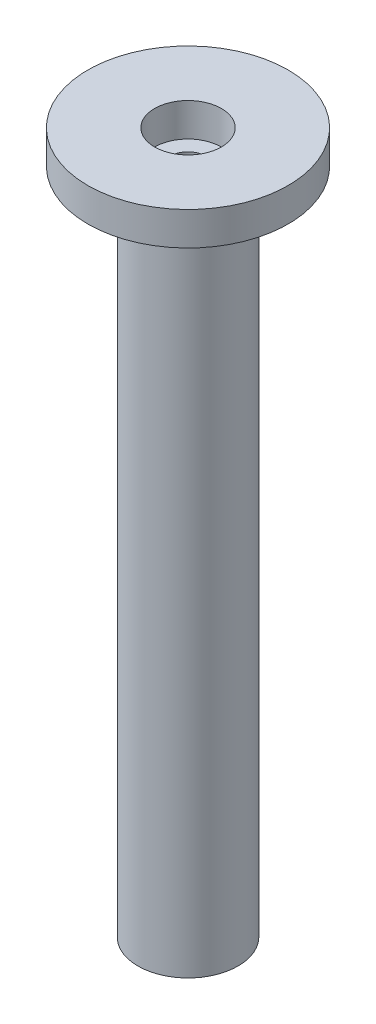
ISO-10303-21;
HEADER;
FILE_DESCRIPTION(('STEP AP214'),'2;1');
FILE_NAME('part.step','',(''),(''),'','','');
FILE_SCHEMA(('AUTOMOTIVE_DESIGN { 1 0 10303 214 1 1 1 1 }'));
ENDSEC;
DATA;
#1=APPLICATION_CONTEXT('core data for automotive mechanical design processes');
#2=APPLICATION_PROTOCOL_DEFINITION('international standard','automotive_design',2000,#1);
#3=PRODUCT_CONTEXT('',#1,'mechanical');
#4=PRODUCT('Part','Part','',(#3));
#5=PRODUCT_RELATED_PRODUCT_CATEGORY('part','',(#4));
#6=PRODUCT_DEFINITION_FORMATION('','',#4);
#7=PRODUCT_DEFINITION_CONTEXT('part definition',#1,'design');
#8=PRODUCT_DEFINITION('design','',#6,#7);
#9=PRODUCT_DEFINITION_SHAPE('','',#8);
#10=(LENGTH_UNIT() NAMED_UNIT(*) SI_UNIT(.MILLI.,.METRE.));
#11=(NAMED_UNIT(*) PLANE_ANGLE_UNIT() SI_UNIT($,.RADIAN.));
#12=(NAMED_UNIT(*) SI_UNIT($,.STERADIAN.) SOLID_ANGLE_UNIT());
#13=UNCERTAINTY_MEASURE_WITH_UNIT(LENGTH_MEASURE(1.E-05),#10,'distance_accuracy_value','');
#14=(GEOMETRIC_REPRESENTATION_CONTEXT(3) GLOBAL_UNCERTAINTY_ASSIGNED_CONTEXT((#13)) GLOBAL_UNIT_ASSIGNED_CONTEXT((#10,
#11,#12)) REPRESENTATION_CONTEXT('',''));
#15=CARTESIAN_POINT('',(0.,0.,0.));
#16=DIRECTION('',(0.,0.,1.));
#17=DIRECTION('',(1.,0.,0.));
#18=AXIS2_PLACEMENT_3D('',#15,#16,#17);
#19=CARTESIAN_POINT('',(0.,127.,0.));
#20=DIRECTION('',(0.,-1.,0.));
#21=DIRECTION('',(0.,0.,-1.));
#22=AXIS2_PLACEMENT_3D('',#19,#20,#21);
#23=CYLINDRICAL_SURFACE('',#22,9.525);
#24=CARTESIAN_POINT('',(0.,127.,0.));
#25=DIRECTION('',(0.,1.,0.));
#26=DIRECTION('',(0.,0.,1.));
#27=AXIS2_PLACEMENT_3D('',#24,#25,#26);
#28=CIRCLE('',#27,9.525);
#29=CARTESIAN_POINT('',(0.,127.,9.525));
#30=VERTEX_POINT('',#29);
#31=EDGE_CURVE('E12',#30,#30,#28,.T.);
#32=ORIENTED_EDGE('',*,*,#31,.F.);
#33=EDGE_LOOP('',(#32));
#34=FACE_BOUND('',#33,.T.);
#35=CARTESIAN_POINT('',(0.,0.,0.));
#36=DIRECTION('',(0.,1.,0.));
#37=DIRECTION('',(0.,0.,1.));
#38=AXIS2_PLACEMENT_3D('',#35,#36,#37);
#39=CIRCLE('',#38,9.525);
#40=CARTESIAN_POINT('',(0.,0.,9.525));
#41=VERTEX_POINT('',#40);
#42=EDGE_CURVE('E46',#41,#41,#39,.T.);
#43=ORIENTED_EDGE('',*,*,#42,.T.);
#44=EDGE_LOOP('',(#43));
#45=FACE_BOUND('',#44,.T.);
#46=ADVANCED_FACE('F43',(#34,#45),#23,.T.);
#47=CARTESIAN_POINT('',(0.,0.,0.));
#48=DIRECTION('',(0.,1.,0.));
#49=DIRECTION('',(0.,0.,1.));
#50=AXIS2_PLACEMENT_3D('',#47,#48,#49);
#51=PLANE('',#50);
#52=CARTESIAN_POINT('',(0.,0.,0.));
#53=DIRECTION('',(0.,-1.,0.));
#54=DIRECTION('',(0.,0.,-1.));
#55=AXIS2_PLACEMENT_3D('',#52,#53,#54);
#56=CIRCLE('',#55,6.35);
#57=CARTESIAN_POINT('',(0.,0.,-6.35));
#58=VERTEX_POINT('',#57);
#59=EDGE_CURVE('E67',#58,#58,#56,.T.);
#60=ORIENTED_EDGE('',*,*,#59,.F.);
#61=EDGE_LOOP('',(#60));
#62=FACE_BOUND('',#61,.T.);
#63=ORIENTED_EDGE('',*,*,#42,.F.);
#64=EDGE_LOOP('',(#63));
#65=FACE_BOUND('',#64,.T.);
#66=ADVANCED_FACE('F94',(#62,#65),#51,.F.);
#67=CARTESIAN_POINT('',(0.,127.,0.));
#68=DIRECTION('',(0.,1.,0.));
#69=DIRECTION('',(0.,0.,1.));
#70=AXIS2_PLACEMENT_3D('',#67,#68,#69);
#71=PLANE('',#70);
#72=CARTESIAN_POINT('',(0.,127.,0.));
#73=DIRECTION('',(0.,1.,0.));
#74=DIRECTION('',(0.,0.,1.));
#75=AXIS2_PLACEMENT_3D('',#72,#73,#74);
#76=CIRCLE('',#75,19.05);
#77=CARTESIAN_POINT('',(0.,127.,19.05));
#78=VERTEX_POINT('',#77);
#79=EDGE_CURVE('E55',#78,#78,#76,.T.);
#80=ORIENTED_EDGE('',*,*,#79,.F.);
#81=EDGE_LOOP('',(#80));
#82=FACE_BOUND('',#81,.T.);
#83=ORIENTED_EDGE('',*,*,#31,.T.);
#84=EDGE_LOOP('',(#83));
#85=FACE_BOUND('',#84,.T.);
#86=ADVANCED_FACE('F97',(#82,#85),#71,.F.);
#87=CARTESIAN_POINT('',(0.,133.35,0.));
#88=DIRECTION('',(0.,-1.,0.));
#89=DIRECTION('',(0.,0.,-1.));
#90=AXIS2_PLACEMENT_3D('',#87,#88,#89);
#91=CYLINDRICAL_SURFACE('',#90,19.05);
#92=CARTESIAN_POINT('',(0.,133.35,0.));
#93=DIRECTION('',(0.,1.,0.));
#94=DIRECTION('',(0.,0.,1.));
#95=AXIS2_PLACEMENT_3D('',#92,#93,#94);
#96=CIRCLE('',#95,19.05);
#97=CARTESIAN_POINT('',(0.,133.35,19.05));
#98=VERTEX_POINT('',#97);
#99=EDGE_CURVE('E53',#98,#98,#96,.T.);
#100=ORIENTED_EDGE('',*,*,#99,.F.);
#101=EDGE_LOOP('',(#100));
#102=FACE_BOUND('',#101,.T.);
#103=ORIENTED_EDGE('',*,*,#79,.T.);
#104=EDGE_LOOP('',(#103));
#105=FACE_BOUND('',#104,.T.);
#106=ADVANCED_FACE('F116',(#102,#105),#91,.T.);
#107=CARTESIAN_POINT('',(0.,133.35,0.));
#108=DIRECTION('',(0.,1.,0.));
#109=DIRECTION('',(0.,0.,1.));
#110=AXIS2_PLACEMENT_3D('',#107,#108,#109);
#111=PLANE('',#110);
#112=CARTESIAN_POINT('',(0.,133.35,0.));
#113=DIRECTION('',(0.,1.,0.));
#114=DIRECTION('',(0.,0.,1.));
#115=AXIS2_PLACEMENT_3D('',#112,#113,#114);
#116=CIRCLE('',#115,6.35);
#117=CARTESIAN_POINT('',(0.,133.35,6.35));
#118=VERTEX_POINT('',#117);
#119=EDGE_CURVE('E61',#118,#118,#116,.T.);
#120=ORIENTED_EDGE('',*,*,#119,.F.);
#121=EDGE_LOOP('',(#120));
#122=FACE_BOUND('',#121,.T.);
#123=ORIENTED_EDGE('',*,*,#99,.T.);
#124=EDGE_LOOP('',(#123));
#125=FACE_BOUND('',#124,.T.);
#126=ADVANCED_FACE('F124',(#122,#125),#111,.T.);
#127=CARTESIAN_POINT('',(0.,127.,0.));
#128=DIRECTION('',(0.,1.,0.));
#129=DIRECTION('',(0.,0.,1.));
#130=AXIS2_PLACEMENT_3D('',#127,#128,#129);
#131=CYLINDRICAL_SURFACE('',#130,6.35);
#132=CARTESIAN_POINT('',(0.,127.,0.));
#133=DIRECTION('',(0.,1.,0.));
#134=DIRECTION('',(0.,0.,1.));
#135=AXIS2_PLACEMENT_3D('',#132,#133,#134);
#136=CIRCLE('',#135,6.35);
#137=CARTESIAN_POINT('',(0.,127.,6.35));
#138=VERTEX_POINT('',#137);
#139=EDGE_CURVE('E58',#138,#138,#136,.T.);
#140=ORIENTED_EDGE('',*,*,#139,.F.);
#141=EDGE_LOOP('',(#140));
#142=FACE_BOUND('',#141,.T.);
#143=ORIENTED_EDGE('',*,*,#119,.T.);
#144=EDGE_LOOP('',(#143));
#145=FACE_BOUND('',#144,.T.);
#146=ADVANCED_FACE('F132',(#142,#145),#131,.F.);
#147=CARTESIAN_POINT('',(0.,127.,0.));
#148=DIRECTION('',(0.,1.,0.));
#149=DIRECTION('',(0.,0.,1.));
#150=AXIS2_PLACEMENT_3D('',#147,#148,#149);
#151=PLANE('',#150);
#152=CARTESIAN_POINT('',(0.,127.,0.));
#153=DIRECTION('',(0.,1.,0.));
#154=DIRECTION('',(0.,0.,1.));
#155=AXIS2_PLACEMENT_3D('',#152,#153,#154);
#156=CIRCLE('',#155,3.3734375);
#157=CARTESIAN_POINT('',(0.,127.,3.3734375));
#158=VERTEX_POINT('',#157);
#159=EDGE_CURVE('E70',#158,#158,#156,.T.);
#160=ORIENTED_EDGE('',*,*,#159,.F.);
#161=EDGE_LOOP('',(#160));
#162=FACE_BOUND('',#161,.T.);
#163=ORIENTED_EDGE('',*,*,#139,.T.);
#164=EDGE_LOOP('',(#163));
#165=FACE_BOUND('',#164,.T.);
#166=ADVANCED_FACE('F90',(#162,#165),#151,.T.);
#167=CARTESIAN_POINT('',(0.,6.35,0.));
#168=DIRECTION('',(0.,-1.,0.));
#169=DIRECTION('',(0.,0.,-1.));
#170=AXIS2_PLACEMENT_3D('',#167,#168,#169);
#171=CYLINDRICAL_SURFACE('',#170,6.35);
#172=CARTESIAN_POINT('',(0.,6.35,0.));
#173=DIRECTION('',(0.,-1.,0.));
#174=DIRECTION('',(0.,0.,-1.));
#175=AXIS2_PLACEMENT_3D('',#172,#173,#174);
#176=CIRCLE('',#175,6.35);
#177=CARTESIAN_POINT('',(0.,6.35,-6.35));
#178=VERTEX_POINT('',#177);
#179=EDGE_CURVE('E64',#178,#178,#176,.T.);
#180=ORIENTED_EDGE('',*,*,#179,.F.);
#181=EDGE_LOOP('',(#180));
#182=FACE_BOUND('',#181,.T.);
#183=ORIENTED_EDGE('',*,*,#59,.T.);
#184=EDGE_LOOP('',(#183));
#185=FACE_BOUND('',#184,.T.);
#186=ADVANCED_FACE('F84',(#182,#185),#171,.F.);
#187=CARTESIAN_POINT('',(0.,6.35,0.));
#188=DIRECTION('',(0.,-1.,0.));
#189=DIRECTION('',(0.,0.,-1.));
#190=AXIS2_PLACEMENT_3D('',#187,#188,#189);
#191=PLANE('',#190);
#192=CARTESIAN_POINT('',(0.,6.35,0.));
#193=DIRECTION('',(0.,-1.,0.));
#194=DIRECTION('',(0.,0.,-1.));
#195=AXIS2_PLACEMENT_3D('',#192,#193,#194);
#196=CIRCLE('',#195,3.3734375);
#197=CARTESIAN_POINT('',(0.,6.35,-3.3734375));
#198=VERTEX_POINT('',#197);
#199=EDGE_CURVE('E75',#198,#198,#196,.T.);
#200=ORIENTED_EDGE('',*,*,#199,.F.);
#201=EDGE_LOOP('',(#200));
#202=FACE_BOUND('',#201,.T.);
#203=ORIENTED_EDGE('',*,*,#179,.T.);
#204=EDGE_LOOP('',(#203));
#205=FACE_BOUND('',#204,.T.);
#206=ADVANCED_FACE('F81',(#202,#205),#191,.T.);
#207=CARTESIAN_POINT('',(0.,133.35,0.));
#208=DIRECTION('',(0.,-1.,0.));
#209=DIRECTION('',(0.,0.,-1.));
#210=AXIS2_PLACEMENT_3D('',#207,#208,#209);
#211=CYLINDRICAL_SURFACE('',#210,3.3734375);
#212=ORIENTED_EDGE('',*,*,#159,.T.);
#213=EDGE_LOOP('',(#212));
#214=FACE_BOUND('',#213,.T.);
#215=ORIENTED_EDGE('',*,*,#199,.T.);
#216=EDGE_LOOP('',(#215));
#217=FACE_BOUND('',#216,.T.);
#218=ADVANCED_FACE('F79',(#214,#217),#211,.F.);
#219=CLOSED_SHELL('',(#46,#66,#86,#106,#126,#146,#166,#186,#206,#218));
#220=MANIFOLD_SOLID_BREP('B2',#219);
#221=ADVANCED_BREP_SHAPE_REPRESENTATION('',(#18,#220),#14);
#222=SHAPE_DEFINITION_REPRESENTATION(#9,#221);
ENDSEC;
END-ISO-10303-21;
